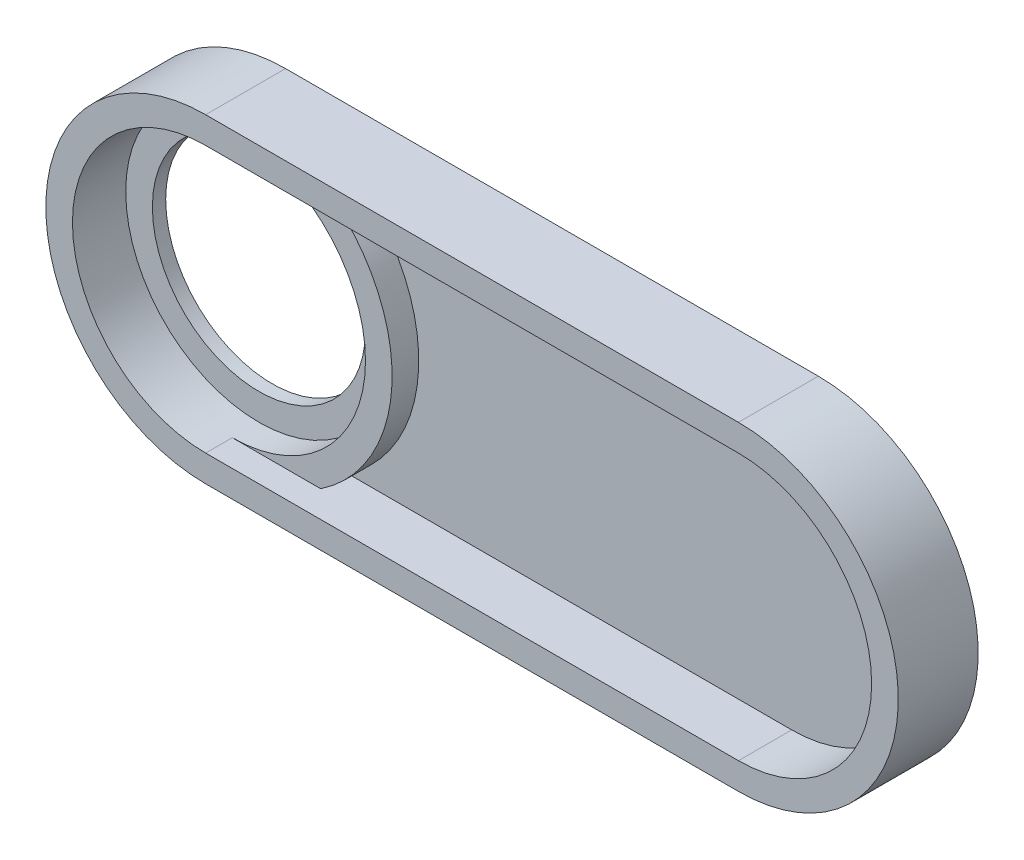
ISO-10303-21;
HEADER;
FILE_DESCRIPTION(('STEP AP214'),'2;1');
FILE_NAME('part.step','',(''),(''),'','','');
FILE_SCHEMA(('AUTOMOTIVE_DESIGN { 1 0 10303 214 1 1 1 1 }'));
ENDSEC;
DATA;
#1=APPLICATION_CONTEXT('core data for automotive mechanical design processes');
#2=APPLICATION_PROTOCOL_DEFINITION('international standard','automotive_design',2000,#1);
#3=PRODUCT_CONTEXT('',#1,'mechanical');
#4=PRODUCT('Part','Part','',(#3));
#5=PRODUCT_RELATED_PRODUCT_CATEGORY('part','',(#4));
#6=PRODUCT_DEFINITION_FORMATION('','',#4);
#7=PRODUCT_DEFINITION_CONTEXT('part definition',#1,'design');
#8=PRODUCT_DEFINITION('design','',#6,#7);
#9=PRODUCT_DEFINITION_SHAPE('','',#8);
#10=(LENGTH_UNIT() NAMED_UNIT(*) SI_UNIT(.MILLI.,.METRE.));
#11=(NAMED_UNIT(*) PLANE_ANGLE_UNIT() SI_UNIT($,.RADIAN.));
#12=(NAMED_UNIT(*) SI_UNIT($,.STERADIAN.) SOLID_ANGLE_UNIT());
#13=UNCERTAINTY_MEASURE_WITH_UNIT(LENGTH_MEASURE(1.E-05),#10,'distance_accuracy_value','');
#14=(GEOMETRIC_REPRESENTATION_CONTEXT(3) GLOBAL_UNCERTAINTY_ASSIGNED_CONTEXT((#13)) GLOBAL_UNIT_ASSIGNED_CONTEXT((#10,
#11,#12)) REPRESENTATION_CONTEXT('',''));
#15=CARTESIAN_POINT('',(0.,0.,0.));
#16=DIRECTION('',(0.,0.,1.));
#17=DIRECTION('',(1.,0.,0.));
#18=AXIS2_PLACEMENT_3D('',#15,#16,#17);
#19=CARTESIAN_POINT('',(0.,0.,10.));
#20=DIRECTION('',(0.,0.,-1.));
#21=DIRECTION('',(-1.,0.,0.));
#22=AXIS2_PLACEMENT_3D('',#19,#20,#21);
#23=CYLINDRICAL_SURFACE('',#22,60.);
#24=DIRECTION('',(0.,0.,-1.));
#25=VECTOR('',#24,1.);
#26=CARTESIAN_POINT('',(0.,-60.,10.));
#27=LINE('',#26,#25);
#28=CARTESIAN_POINT('',(0.,-60.,30.));
#29=VERTEX_POINT('',#28);
#30=CARTESIAN_POINT('',(0.,-60.,0.));
#31=VERTEX_POINT('',#30);
#32=EDGE_CURVE('E177',#29,#31,#27,.T.);
#33=ORIENTED_EDGE('',*,*,#32,.F.);
#34=CARTESIAN_POINT('',(0.,0.,30.));
#35=DIRECTION('',(0.,0.,1.));
#36=DIRECTION('',(1.,0.,0.));
#37=AXIS2_PLACEMENT_3D('',#34,#35,#36);
#38=CIRCLE('',#37,60.);
#39=CARTESIAN_POINT('',(0.,60.,30.));
#40=VERTEX_POINT('',#39);
#41=EDGE_CURVE('E129',#40,#29,#38,.T.);
#42=ORIENTED_EDGE('',*,*,#41,.F.);
#43=DIRECTION('',(0.,0.,-1.));
#44=VECTOR('',#43,1.);
#45=CARTESIAN_POINT('',(0.,60.,10.));
#46=LINE('',#45,#44);
#47=CARTESIAN_POINT('',(0.,60.,0.));
#48=VERTEX_POINT('',#47);
#49=EDGE_CURVE('E196',#40,#48,#46,.T.);
#50=ORIENTED_EDGE('',*,*,#49,.T.);
#51=CARTESIAN_POINT('',(0.,0.,0.));
#52=DIRECTION('',(0.,0.,1.));
#53=DIRECTION('',(1.,0.,0.));
#54=AXIS2_PLACEMENT_3D('',#51,#52,#53);
#55=CIRCLE('',#54,60.);
#56=EDGE_CURVE('E187',#48,#31,#55,.T.);
#57=ORIENTED_EDGE('',*,*,#56,.T.);
#58=EDGE_LOOP('',(#33,#42,#50,#57));
#59=FACE_BOUND('',#58,.T.);
#60=ADVANCED_FACE('F35',(#59),#23,.T.);
#61=CARTESIAN_POINT('',(0.,0.,10.));
#62=DIRECTION('',(0.,0.,1.));
#63=DIRECTION('',(1.,0.,0.));
#64=AXIS2_PLACEMENT_3D('',#61,#62,#63);
#65=PLANE('',#64);
#66=CARTESIAN_POINT('',(0.,0.,10.));
#67=DIRECTION('',(0.,0.,1.));
#68=DIRECTION('',(1.,0.,0.));
#69=AXIS2_PLACEMENT_3D('',#66,#67,#68);
#70=CIRCLE('',#69,40.);
#71=CARTESIAN_POINT('',(40.,0.,10.));
#72=VERTEX_POINT('',#71);
#73=EDGE_CURVE('E184',#72,#72,#70,.T.);
#74=ORIENTED_EDGE('',*,*,#73,.F.);
#75=EDGE_LOOP('',(#74));
#76=FACE_BOUND('',#75,.T.);
#77=CARTESIAN_POINT('',(0.,0.,10.));
#78=DIRECTION('',(0.,0.,1.));
#79=DIRECTION('',(1.,0.,0.));
#80=AXIS2_PLACEMENT_3D('',#77,#78,#79);
#81=CIRCLE('',#80,50.);
#82=CARTESIAN_POINT('',(50.,0.,10.));
#83=VERTEX_POINT('',#82);
#84=EDGE_CURVE('E164',#83,#83,#81,.T.);
#85=ORIENTED_EDGE('',*,*,#84,.T.);
#86=EDGE_LOOP('',(#85));
#87=FACE_BOUND('',#86,.T.);
#88=ADVANCED_FACE('F223',(#76,#87),#65,.T.);
#89=CARTESIAN_POINT('',(0.,0.,10.));
#90=DIRECTION('',(0.,0.,-1.));
#91=DIRECTION('',(-1.,0.,0.));
#92=AXIS2_PLACEMENT_3D('',#89,#90,#91);
#93=CYLINDRICAL_SURFACE('',#92,40.);
#94=ORIENTED_EDGE('',*,*,#73,.T.);
#95=EDGE_LOOP('',(#94));
#96=FACE_BOUND('',#95,.T.);
#97=CARTESIAN_POINT('',(0.,0.,5.));
#98=DIRECTION('',(0.,0.,-1.));
#99=DIRECTION('',(-1.,0.,0.));
#100=AXIS2_PLACEMENT_3D('',#97,#98,#99);
#101=CIRCLE('',#100,40.);
#102=CARTESIAN_POINT('',(-40.,0.,5.));
#103=VERTEX_POINT('',#102);
#104=EDGE_CURVE('E181',#103,#103,#101,.T.);
#105=ORIENTED_EDGE('',*,*,#104,.T.);
#106=EDGE_LOOP('',(#105));
#107=FACE_BOUND('',#106,.T.);
#108=ADVANCED_FACE('F221',(#96,#107),#93,.F.);
#109=DIRECTION('',(-1.,0.,0.));
#110=VECTOR('',#109,1.);
#111=CARTESIAN_POINT('',(200.,50.,10.));
#112=LINE('',#111,#110);
#113=CARTESIAN_POINT('',(200.,50.,10.));
#114=VERTEX_POINT('',#113);
#115=CARTESIAN_POINT('',(33.166247903554,50.,10.));
#116=VERTEX_POINT('',#115);
#117=EDGE_CURVE('E128',#114,#116,#112,.T.);
#118=ORIENTED_EDGE('',*,*,#117,.T.);
#119=CARTESIAN_POINT('',(0.,0.,10.));
#120=DIRECTION('',(0.,0.,1.));
#121=DIRECTION('',(1.,0.,0.));
#122=AXIS2_PLACEMENT_3D('',#119,#120,#121);
#123=CIRCLE('',#122,60.);
#124=CARTESIAN_POINT('',(33.166247903554,-50.,10.));
#125=VERTEX_POINT('',#124);
#126=EDGE_CURVE('E174',#125,#116,#123,.T.);
#127=ORIENTED_EDGE('',*,*,#126,.F.);
#128=DIRECTION('',(1.,0.,0.));
#129=VECTOR('',#128,1.);
#130=CARTESIAN_POINT('',(0.,-50.,10.));
#131=LINE('',#130,#129);
#132=CARTESIAN_POINT('',(200.,-50.,10.));
#133=VERTEX_POINT('',#132);
#134=EDGE_CURVE('E55',#125,#133,#131,.T.);
#135=ORIENTED_EDGE('',*,*,#134,.T.);
#136=CARTESIAN_POINT('',(200.,0.,10.));
#137=DIRECTION('',(0.,0.,1.));
#138=DIRECTION('',(1.,0.,0.));
#139=AXIS2_PLACEMENT_3D('',#136,#137,#138);
#140=CIRCLE('',#139,50.);
#141=EDGE_CURVE('E50',#133,#114,#140,.T.);
#142=ORIENTED_EDGE('',*,*,#141,.T.);
#143=EDGE_LOOP('',(#118,#127,#135,#142));
#144=FACE_BOUND('',#143,.T.);
#145=ADVANCED_FACE('F218',(#144),#65,.T.);
#146=CARTESIAN_POINT('',(0.,0.,0.));
#147=DIRECTION('',(0.,0.,1.));
#148=DIRECTION('',(1.,0.,0.));
#149=AXIS2_PLACEMENT_3D('',#146,#147,#148);
#150=PLANE('',#149);
#151=CARTESIAN_POINT('',(0.,0.,0.));
#152=DIRECTION('',(0.,0.,-1.));
#153=DIRECTION('',(-1.,0.,0.));
#154=AXIS2_PLACEMENT_3D('',#151,#152,#153);
#155=CIRCLE('',#154,52.5);
#156=CARTESIAN_POINT('',(-52.5,0.,0.));
#157=VERTEX_POINT('',#156);
#158=EDGE_CURVE('E171',#157,#157,#155,.T.);
#159=ORIENTED_EDGE('',*,*,#158,.F.);
#160=EDGE_LOOP('',(#159));
#161=FACE_BOUND('',#160,.T.);
#162=ORIENTED_EDGE('',*,*,#56,.F.);
#163=DIRECTION('',(-1.,0.,0.));
#164=VECTOR('',#163,1.);
#165=CARTESIAN_POINT('',(0.,60.,0.));
#166=LINE('',#165,#164);
#167=CARTESIAN_POINT('',(200.,60.,0.));
#168=VERTEX_POINT('',#167);
#169=EDGE_CURVE('E194',#168,#48,#166,.T.);
#170=ORIENTED_EDGE('',*,*,#169,.F.);
#171=CARTESIAN_POINT('',(200.,0.,0.));
#172=DIRECTION('',(0.,0.,1.));
#173=DIRECTION('',(1.,0.,0.));
#174=AXIS2_PLACEMENT_3D('',#171,#172,#173);
#175=CIRCLE('',#174,60.);
#176=CARTESIAN_POINT('',(200.,-60.,0.));
#177=VERTEX_POINT('',#176);
#178=EDGE_CURVE('E192',#177,#168,#175,.T.);
#179=ORIENTED_EDGE('',*,*,#178,.F.);
#180=DIRECTION('',(1.,0.,0.));
#181=VECTOR('',#180,1.);
#182=CARTESIAN_POINT('',(0.,-60.,0.));
#183=LINE('',#182,#181);
#184=EDGE_CURVE('E190',#31,#177,#183,.T.);
#185=ORIENTED_EDGE('',*,*,#184,.F.);
#186=EDGE_LOOP('',(#162,#170,#179,#185));
#187=FACE_BOUND('',#186,.T.);
#188=ADVANCED_FACE('F220',(#161,#187),#150,.F.);
#189=ORIENTED_EDGE('',*,*,#126,.T.);
#190=DIRECTION('',(0.,0.,-1.));
#191=VECTOR('',#190,1.);
#192=CARTESIAN_POINT('',(33.166247903554,50.,10.));
#193=LINE('',#192,#191);
#194=CARTESIAN_POINT('',(33.166247903554,50.,20.));
#195=VERTEX_POINT('',#194);
#196=EDGE_CURVE('E162',#116,#195,#193,.F.);
#197=ORIENTED_EDGE('',*,*,#196,.T.);
#198=CARTESIAN_POINT('',(0.,0.,20.));
#199=DIRECTION('',(0.,0.,1.));
#200=DIRECTION('',(1.,0.,0.));
#201=AXIS2_PLACEMENT_3D('',#198,#199,#200);
#202=CIRCLE('',#201,60.);
#203=CARTESIAN_POINT('',(33.166247903554,-50.,20.));
#204=VERTEX_POINT('',#203);
#205=EDGE_CURVE('E168',#204,#195,#202,.T.);
#206=ORIENTED_EDGE('',*,*,#205,.F.);
#207=DIRECTION('',(0.,0.,-1.));
#208=VECTOR('',#207,1.);
#209=CARTESIAN_POINT('',(33.166247903554,-50.,10.));
#210=LINE('',#209,#208);
#211=EDGE_CURVE('E160',#204,#125,#210,.T.);
#212=ORIENTED_EDGE('',*,*,#211,.T.);
#213=EDGE_LOOP('',(#189,#197,#206,#212));
#214=FACE_BOUND('',#213,.T.);
#215=ADVANCED_FACE('F37',(#214),#23,.T.);
#216=CARTESIAN_POINT('',(0.,-60.,10.));
#217=DIRECTION('',(0.,1.,0.));
#218=DIRECTION('',(0.,0.,1.));
#219=AXIS2_PLACEMENT_3D('',#216,#217,#218);
#220=PLANE('',#219);
#221=ORIENTED_EDGE('',*,*,#184,.T.);
#222=DIRECTION('',(0.,0.,-1.));
#223=VECTOR('',#222,1.);
#224=CARTESIAN_POINT('',(200.,-60.,10.));
#225=LINE('',#224,#223);
#226=CARTESIAN_POINT('',(200.,-60.,30.));
#227=VERTEX_POINT('',#226);
#228=EDGE_CURVE('E202',#227,#177,#225,.T.);
#229=ORIENTED_EDGE('',*,*,#228,.F.);
#230=DIRECTION('',(1.,0.,0.));
#231=VECTOR('',#230,1.);
#232=CARTESIAN_POINT('',(0.,-60.,30.));
#233=LINE('',#232,#231);
#234=EDGE_CURVE('E151',#29,#227,#233,.T.);
#235=ORIENTED_EDGE('',*,*,#234,.F.);
#236=ORIENTED_EDGE('',*,*,#32,.T.);
#237=EDGE_LOOP('',(#221,#229,#235,#236));
#238=FACE_BOUND('',#237,.T.);
#239=ADVANCED_FACE('F241',(#238),#220,.F.);
#240=CARTESIAN_POINT('',(200.,0.,10.));
#241=DIRECTION('',(0.,0.,-1.));
#242=DIRECTION('',(-1.,0.,0.));
#243=AXIS2_PLACEMENT_3D('',#240,#241,#242);
#244=CYLINDRICAL_SURFACE('',#243,60.);
#245=ORIENTED_EDGE('',*,*,#178,.T.);
#246=DIRECTION('',(0.,0.,-1.));
#247=VECTOR('',#246,1.);
#248=CARTESIAN_POINT('',(200.,60.,10.));
#249=LINE('',#248,#247);
#250=CARTESIAN_POINT('',(200.,60.,30.));
#251=VERTEX_POINT('',#250);
#252=EDGE_CURVE('E199',#251,#168,#249,.T.);
#253=ORIENTED_EDGE('',*,*,#252,.F.);
#254=CARTESIAN_POINT('',(200.,0.,30.));
#255=DIRECTION('',(0.,0.,1.));
#256=DIRECTION('',(1.,0.,0.));
#257=AXIS2_PLACEMENT_3D('',#254,#255,#256);
#258=CIRCLE('',#257,60.);
#259=EDGE_CURVE('E154',#227,#251,#258,.T.);
#260=ORIENTED_EDGE('',*,*,#259,.F.);
#261=ORIENTED_EDGE('',*,*,#228,.T.);
#262=EDGE_LOOP('',(#245,#253,#260,#261));
#263=FACE_BOUND('',#262,.T.);
#264=ADVANCED_FACE('F245',(#263),#244,.T.);
#265=CARTESIAN_POINT('',(0.,60.,10.));
#266=DIRECTION('',(0.,-1.,0.));
#267=DIRECTION('',(0.,0.,-1.));
#268=AXIS2_PLACEMENT_3D('',#265,#266,#267);
#269=PLANE('',#268);
#270=ORIENTED_EDGE('',*,*,#169,.T.);
#271=ORIENTED_EDGE('',*,*,#49,.F.);
#272=DIRECTION('',(-1.,0.,0.));
#273=VECTOR('',#272,1.);
#274=CARTESIAN_POINT('',(200.,60.,30.));
#275=LINE('',#274,#273);
#276=EDGE_CURVE('E157',#251,#40,#275,.T.);
#277=ORIENTED_EDGE('',*,*,#276,.F.);
#278=ORIENTED_EDGE('',*,*,#252,.T.);
#279=EDGE_LOOP('',(#270,#271,#277,#278));
#280=FACE_BOUND('',#279,.T.);
#281=ADVANCED_FACE('F249',(#280),#269,.F.);
#282=CARTESIAN_POINT('',(0.,0.,5.));
#283=DIRECTION('',(0.,0.,-1.));
#284=DIRECTION('',(-1.,0.,0.));
#285=AXIS2_PLACEMENT_3D('',#282,#283,#284);
#286=CYLINDRICAL_SURFACE('',#285,52.5);
#287=CARTESIAN_POINT('',(0.,0.,5.));
#288=DIRECTION('',(0.,0.,-1.));
#289=DIRECTION('',(-1.,0.,0.));
#290=AXIS2_PLACEMENT_3D('',#287,#288,#289);
#291=CIRCLE('',#290,52.5);
#292=CARTESIAN_POINT('',(-52.5,0.,5.));
#293=VERTEX_POINT('',#292);
#294=EDGE_CURVE('E178',#293,#293,#291,.T.);
#295=ORIENTED_EDGE('',*,*,#294,.F.);
#296=EDGE_LOOP('',(#295));
#297=FACE_BOUND('',#296,.T.);
#298=ORIENTED_EDGE('',*,*,#158,.T.);
#299=EDGE_LOOP('',(#298));
#300=FACE_BOUND('',#299,.T.);
#301=ADVANCED_FACE('F254',(#297,#300),#286,.F.);
#302=CARTESIAN_POINT('',(0.,0.,5.));
#303=DIRECTION('',(0.,0.,-1.));
#304=DIRECTION('',(-1.,0.,0.));
#305=AXIS2_PLACEMENT_3D('',#302,#303,#304);
#306=PLANE('',#305);
#307=ORIENTED_EDGE('',*,*,#104,.F.);
#308=EDGE_LOOP('',(#307));
#309=FACE_BOUND('',#308,.T.);
#310=ORIENTED_EDGE('',*,*,#294,.T.);
#311=EDGE_LOOP('',(#310));
#312=FACE_BOUND('',#311,.T.);
#313=ADVANCED_FACE('F260',(#309,#312),#306,.T.);
#314=CARTESIAN_POINT('',(0.,0.,20.));
#315=DIRECTION('',(0.,0.,-1.));
#316=DIRECTION('',(-1.,0.,0.));
#317=AXIS2_PLACEMENT_3D('',#314,#315,#316);
#318=CYLINDRICAL_SURFACE('',#317,50.);
#319=ORIENTED_EDGE('',*,*,#84,.F.);
#320=EDGE_LOOP('',(#319));
#321=FACE_BOUND('',#320,.T.);
#322=CARTESIAN_POINT('',(0.,0.,20.));
#323=DIRECTION('',(0.,0.,1.));
#324=DIRECTION('',(1.,0.,0.));
#325=AXIS2_PLACEMENT_3D('',#322,#323,#324);
#326=CIRCLE('',#325,50.);
#327=CARTESIAN_POINT('',(0.,-50.,20.));
#328=VERTEX_POINT('',#327);
#329=CARTESIAN_POINT('',(0.,50.,20.));
#330=VERTEX_POINT('',#329);
#331=EDGE_CURVE('E165',#328,#330,#326,.T.);
#332=ORIENTED_EDGE('',*,*,#331,.T.);
#333=DIRECTION('',(0.,0.,-1.));
#334=VECTOR('',#333,1.);
#335=CARTESIAN_POINT('',(0.,50.,30.));
#336=LINE('',#335,#334);
#337=CARTESIAN_POINT('',(0.,50.,30.));
#338=VERTEX_POINT('',#337);
#339=EDGE_CURVE('E130',#338,#330,#336,.T.);
#340=ORIENTED_EDGE('',*,*,#339,.F.);
#341=CARTESIAN_POINT('',(0.,0.,30.));
#342=DIRECTION('',(0.,0.,1.));
#343=DIRECTION('',(1.,0.,0.));
#344=AXIS2_PLACEMENT_3D('',#341,#342,#343);
#345=CIRCLE('',#344,50.);
#346=CARTESIAN_POINT('',(0.,-50.,30.));
#347=VERTEX_POINT('',#346);
#348=EDGE_CURVE('E135',#338,#347,#345,.T.);
#349=ORIENTED_EDGE('',*,*,#348,.T.);
#350=DIRECTION('',(0.,0.,-1.));
#351=VECTOR('',#350,1.);
#352=CARTESIAN_POINT('',(0.,-50.,30.));
#353=LINE('',#352,#351);
#354=EDGE_CURVE('E145',#347,#328,#353,.T.);
#355=ORIENTED_EDGE('',*,*,#354,.T.);
#356=EDGE_LOOP('',(#332,#340,#349,#355));
#357=FACE_BOUND('',#356,.T.);
#358=ADVANCED_FACE('F215',(#321,#357),#318,.F.);
#359=CARTESIAN_POINT('',(0.,0.,20.));
#360=DIRECTION('',(0.,0.,1.));
#361=DIRECTION('',(1.,0.,0.));
#362=AXIS2_PLACEMENT_3D('',#359,#360,#361);
#363=PLANE('',#362);
#364=DIRECTION('',(1.,0.,0.));
#365=VECTOR('',#364,1.);
#366=CARTESIAN_POINT('',(0.,50.,20.));
#367=LINE('',#366,#365);
#368=EDGE_CURVE('E11',#330,#195,#367,.T.);
#369=ORIENTED_EDGE('',*,*,#368,.F.);
#370=ORIENTED_EDGE('',*,*,#331,.F.);
#371=DIRECTION('',(-1.,0.,0.));
#372=VECTOR('',#371,1.);
#373=CARTESIAN_POINT('',(0.,-50.,20.));
#374=LINE('',#373,#372);
#375=EDGE_CURVE('E43',#204,#328,#374,.T.);
#376=ORIENTED_EDGE('',*,*,#375,.F.);
#377=ORIENTED_EDGE('',*,*,#205,.T.);
#378=EDGE_LOOP('',(#369,#370,#376,#377));
#379=FACE_BOUND('',#378,.T.);
#380=ADVANCED_FACE('F216',(#379),#363,.T.);
#381=CARTESIAN_POINT('',(200.,50.,30.));
#382=DIRECTION('',(0.,-1.,0.));
#383=DIRECTION('',(0.,0.,-1.));
#384=AXIS2_PLACEMENT_3D('',#381,#382,#383);
#385=PLANE('',#384);
#386=ORIENTED_EDGE('',*,*,#196,.F.);
#387=ORIENTED_EDGE('',*,*,#117,.F.);
#388=DIRECTION('',(0.,0.,-1.));
#389=VECTOR('',#388,1.);
#390=CARTESIAN_POINT('',(200.,50.,30.));
#391=LINE('',#390,#389);
#392=CARTESIAN_POINT('',(200.,50.,30.));
#393=VERTEX_POINT('',#392);
#394=EDGE_CURVE('E115',#393,#114,#391,.T.);
#395=ORIENTED_EDGE('',*,*,#394,.F.);
#396=DIRECTION('',(-1.,0.,0.));
#397=VECTOR('',#396,1.);
#398=CARTESIAN_POINT('',(200.,50.,30.));
#399=LINE('',#398,#397);
#400=EDGE_CURVE('E121',#393,#338,#399,.T.);
#401=ORIENTED_EDGE('',*,*,#400,.T.);
#402=ORIENTED_EDGE('',*,*,#339,.T.);
#403=ORIENTED_EDGE('',*,*,#368,.T.);
#404=EDGE_LOOP('',(#386,#387,#395,#401,#402,#403));
#405=FACE_BOUND('',#404,.T.);
#406=ADVANCED_FACE('F125',(#405),#385,.T.);
#407=CARTESIAN_POINT('',(0.,-50.,30.));
#408=DIRECTION('',(0.,1.,0.));
#409=DIRECTION('',(0.,0.,1.));
#410=AXIS2_PLACEMENT_3D('',#407,#408,#409);
#411=PLANE('',#410);
#412=ORIENTED_EDGE('',*,*,#211,.F.);
#413=ORIENTED_EDGE('',*,*,#375,.T.);
#414=ORIENTED_EDGE('',*,*,#354,.F.);
#415=DIRECTION('',(1.,0.,0.));
#416=VECTOR('',#415,1.);
#417=CARTESIAN_POINT('',(0.,-50.,30.));
#418=LINE('',#417,#416);
#419=CARTESIAN_POINT('',(200.,-50.,30.));
#420=VERTEX_POINT('',#419);
#421=EDGE_CURVE('E137',#347,#420,#418,.T.);
#422=ORIENTED_EDGE('',*,*,#421,.T.);
#423=DIRECTION('',(0.,0.,-1.));
#424=VECTOR('',#423,1.);
#425=CARTESIAN_POINT('',(200.,-50.,30.));
#426=LINE('',#425,#424);
#427=EDGE_CURVE('E117',#420,#133,#426,.T.);
#428=ORIENTED_EDGE('',*,*,#427,.T.);
#429=ORIENTED_EDGE('',*,*,#134,.F.);
#430=EDGE_LOOP('',(#412,#413,#414,#422,#428,#429));
#431=FACE_BOUND('',#430,.T.);
#432=ADVANCED_FACE('F211',(#431),#411,.T.);
#433=CARTESIAN_POINT('',(0.,0.,30.));
#434=DIRECTION('',(0.,0.,1.));
#435=DIRECTION('',(1.,0.,0.));
#436=AXIS2_PLACEMENT_3D('',#433,#434,#435);
#437=PLANE('',#436);
#438=ORIENTED_EDGE('',*,*,#41,.T.);
#439=ORIENTED_EDGE('',*,*,#234,.T.);
#440=ORIENTED_EDGE('',*,*,#259,.T.);
#441=ORIENTED_EDGE('',*,*,#276,.T.);
#442=EDGE_LOOP('',(#438,#439,#440,#441));
#443=FACE_BOUND('',#442,.T.);
#444=ORIENTED_EDGE('',*,*,#400,.F.);
#445=CARTESIAN_POINT('',(200.,0.,30.));
#446=DIRECTION('',(0.,0.,1.));
#447=DIRECTION('',(1.,0.,0.));
#448=AXIS2_PLACEMENT_3D('',#445,#446,#447);
#449=CIRCLE('',#448,50.);
#450=EDGE_CURVE('E112',#420,#393,#449,.T.);
#451=ORIENTED_EDGE('',*,*,#450,.F.);
#452=ORIENTED_EDGE('',*,*,#421,.F.);
#453=ORIENTED_EDGE('',*,*,#348,.F.);
#454=EDGE_LOOP('',(#444,#451,#452,#453));
#455=FACE_BOUND('',#454,.T.);
#456=ADVANCED_FACE('F133',(#443,#455),#437,.T.);
#457=CARTESIAN_POINT('',(200.,0.,30.));
#458=DIRECTION('',(0.,0.,-1.));
#459=DIRECTION('',(-1.,0.,0.));
#460=AXIS2_PLACEMENT_3D('',#457,#458,#459);
#461=CYLINDRICAL_SURFACE('',#460,50.);
#462=ORIENTED_EDGE('',*,*,#141,.F.);
#463=ORIENTED_EDGE('',*,*,#427,.F.);
#464=ORIENTED_EDGE('',*,*,#450,.T.);
#465=ORIENTED_EDGE('',*,*,#394,.T.);
#466=EDGE_LOOP('',(#462,#463,#464,#465));
#467=FACE_BOUND('',#466,.T.);
#468=ADVANCED_FACE('F114',(#467),#461,.F.);
#469=CLOSED_SHELL('',(#60,#88,#108,#145,#188,#215,#239,#264,#281,#301,#313,#358,#380,#406,#432,
#456,#468));
#470=MANIFOLD_SOLID_BREP('B2',#469);
#471=ADVANCED_BREP_SHAPE_REPRESENTATION('',(#18,#470),#14);
#472=SHAPE_DEFINITION_REPRESENTATION(#9,#471);
ENDSEC;
END-ISO-10303-21;
